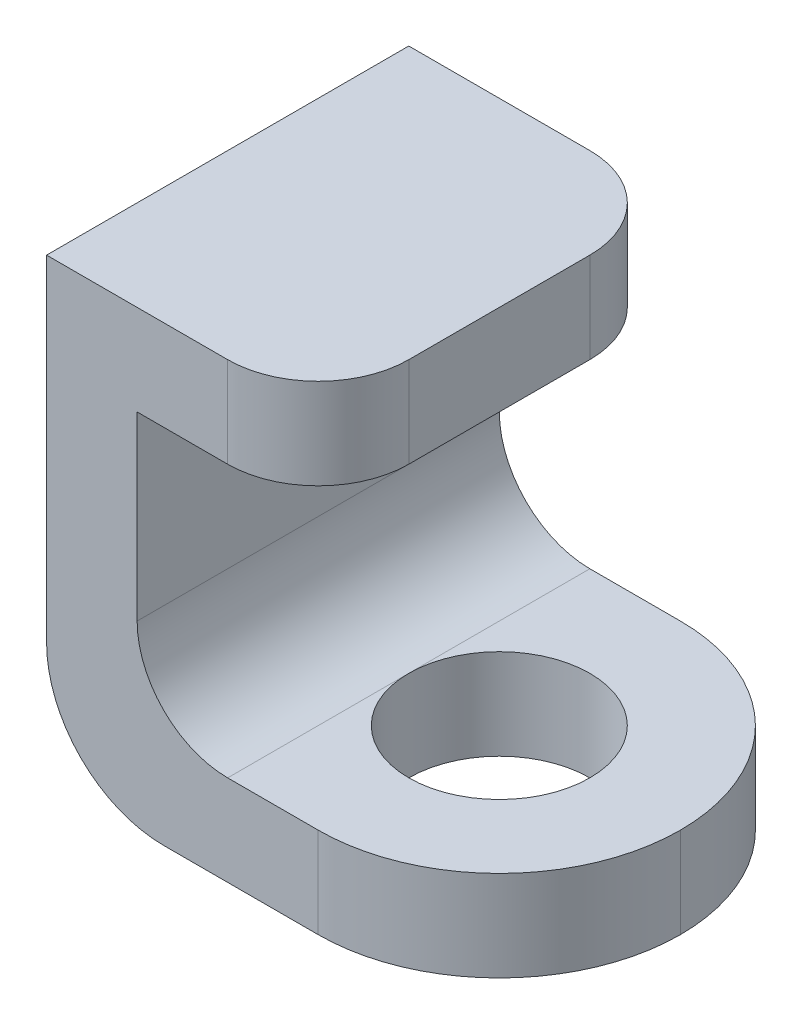
ISO-10303-21;
HEADER;
FILE_DESCRIPTION(('STEP AP214'),'2;1');
FILE_NAME('part.step','',(''),(''),'','','');
FILE_SCHEMA(('AUTOMOTIVE_DESIGN { 1 0 10303 214 1 1 1 1 }'));
ENDSEC;
DATA;
#1=APPLICATION_CONTEXT('core data for automotive mechanical design processes');
#2=APPLICATION_PROTOCOL_DEFINITION('international standard','automotive_design',2000,#1);
#3=PRODUCT_CONTEXT('',#1,'mechanical');
#4=PRODUCT('Part','Part','',(#3));
#5=PRODUCT_RELATED_PRODUCT_CATEGORY('part','',(#4));
#6=PRODUCT_DEFINITION_FORMATION('','',#4);
#7=PRODUCT_DEFINITION_CONTEXT('part definition',#1,'design');
#8=PRODUCT_DEFINITION('design','',#6,#7);
#9=PRODUCT_DEFINITION_SHAPE('','',#8);
#10=(LENGTH_UNIT() NAMED_UNIT(*) SI_UNIT(.MILLI.,.METRE.));
#11=(NAMED_UNIT(*) PLANE_ANGLE_UNIT() SI_UNIT($,.RADIAN.));
#12=(NAMED_UNIT(*) SI_UNIT($,.STERADIAN.) SOLID_ANGLE_UNIT());
#13=UNCERTAINTY_MEASURE_WITH_UNIT(LENGTH_MEASURE(1.E-05),#10,'distance_accuracy_value','');
#14=(GEOMETRIC_REPRESENTATION_CONTEXT(3) GLOBAL_UNCERTAINTY_ASSIGNED_CONTEXT((#13)) GLOBAL_UNIT_ASSIGNED_CONTEXT((#10,
#11,#12)) REPRESENTATION_CONTEXT('',''));
#15=CARTESIAN_POINT('',(0.,0.,0.));
#16=DIRECTION('',(0.,0.,1.));
#17=DIRECTION('',(1.,0.,0.));
#18=AXIS2_PLACEMENT_3D('',#15,#16,#17);
#19=CARTESIAN_POINT('',(-25.,50.,-20.));
#20=DIRECTION('',(0.,0.,1.));
#21=DIRECTION('',(1.,0.,0.));
#22=AXIS2_PLACEMENT_3D('',#19,#20,#21);
#23=PLANE('',#22);
#24=DIRECTION('',(1.,0.,0.));
#25=VECTOR('',#24,1.);
#26=CARTESIAN_POINT('',(0.,10.,-20.));
#27=LINE('',#26,#25);
#28=CARTESIAN_POINT('',(-5.,10.,-20.));
#29=VERTEX_POINT('',#28);
#30=CARTESIAN_POINT('',(5.,10.,-20.));
#31=VERTEX_POINT('',#30);
#32=EDGE_CURVE('E221',#29,#31,#27,.T.);
#33=ORIENTED_EDGE('',*,*,#32,.T.);
#34=DIRECTION('',(0.,-1.,0.));
#35=VECTOR('',#34,1.);
#36=CARTESIAN_POINT('',(5.,50.,-20.));
#37=LINE('',#36,#35);
#38=CARTESIAN_POINT('',(5.,0.,-20.));
#39=VERTEX_POINT('',#38);
#40=EDGE_CURVE('E210',#31,#39,#37,.T.);
#41=ORIENTED_EDGE('',*,*,#40,.T.);
#42=DIRECTION('',(-1.,0.,0.));
#43=VECTOR('',#42,1.);
#44=CARTESIAN_POINT('',(-25.,0.,-20.));
#45=LINE('',#44,#43);
#46=CARTESIAN_POINT('',(-12.0710678118655,0.,-20.));
#47=VERTEX_POINT('',#46);
#48=EDGE_CURVE('E182',#39,#47,#45,.T.);
#49=ORIENTED_EDGE('',*,*,#48,.T.);
#50=CARTESIAN_POINT('',(-12.0710678118655,12.9289321881345,-20.));
#51=DIRECTION('',(0.,0.,1.));
#52=DIRECTION('',(1.,0.,0.));
#53=AXIS2_PLACEMENT_3D('',#50,#51,#52);
#54=CIRCLE('',#53,12.9289321881345);
#55=CARTESIAN_POINT('',(-25.,12.9289321881345,-20.));
#56=VERTEX_POINT('',#55);
#57=EDGE_CURVE('E163',#47,#56,#54,.F.);
#58=ORIENTED_EDGE('',*,*,#57,.T.);
#59=DIRECTION('',(0.,-1.,0.));
#60=VECTOR('',#59,1.);
#61=CARTESIAN_POINT('',(-25.,50.,-20.));
#62=LINE('',#61,#60);
#63=CARTESIAN_POINT('',(-25.,50.,-20.));
#64=VERTEX_POINT('',#63);
#65=EDGE_CURVE('E178',#64,#56,#62,.T.);
#66=ORIENTED_EDGE('',*,*,#65,.F.);
#67=DIRECTION('',(-1.,0.,0.));
#68=VECTOR('',#67,1.);
#69=CARTESIAN_POINT('',(-25.,50.,-20.));
#70=LINE('',#69,#68);
#71=CARTESIAN_POINT('',(-5.,50.,-20.));
#72=VERTEX_POINT('',#71);
#73=EDGE_CURVE('E269',#72,#64,#70,.T.);
#74=ORIENTED_EDGE('',*,*,#73,.F.);
#75=DIRECTION('',(0.,-1.,0.));
#76=VECTOR('',#75,1.);
#77=CARTESIAN_POINT('',(-5.,50.,-20.));
#78=LINE('',#77,#76);
#79=CARTESIAN_POINT('',(-5.,40.,-20.));
#80=VERTEX_POINT('',#79);
#81=EDGE_CURVE('E186',#72,#80,#78,.T.);
#82=ORIENTED_EDGE('',*,*,#81,.T.);
#83=DIRECTION('',(-1.,0.,0.));
#84=VECTOR('',#83,1.);
#85=CARTESIAN_POINT('',(0.,40.,-20.));
#86=LINE('',#85,#84);
#87=CARTESIAN_POINT('',(-15.,40.,-20.));
#88=VERTEX_POINT('',#87);
#89=EDGE_CURVE('E229',#80,#88,#86,.T.);
#90=ORIENTED_EDGE('',*,*,#89,.T.);
#91=DIRECTION('',(0.,-1.,0.));
#92=VECTOR('',#91,1.);
#93=CARTESIAN_POINT('',(-15.,0.,-20.));
#94=LINE('',#93,#92);
#95=CARTESIAN_POINT('',(-15.,20.,-20.));
#96=VERTEX_POINT('',#95);
#97=EDGE_CURVE('E251',#88,#96,#94,.T.);
#98=ORIENTED_EDGE('',*,*,#97,.T.);
#99=CARTESIAN_POINT('',(-5.,20.,-20.));
#100=DIRECTION('',(0.,0.,1.));
#101=DIRECTION('',(1.,0.,0.));
#102=AXIS2_PLACEMENT_3D('',#99,#100,#101);
#103=CIRCLE('',#102,10.);
#104=EDGE_CURVE('E228',#96,#29,#103,.T.);
#105=ORIENTED_EDGE('',*,*,#104,.T.);
#106=EDGE_LOOP('',(#33,#41,#49,#58,#66,#74,#82,#90,#98,#105));
#107=FACE_BOUND('',#106,.T.);
#108=ADVANCED_FACE('F62',(#107),#23,.F.);
#109=CARTESIAN_POINT('',(-25.,50.,20.));
#110=DIRECTION('',(1.,0.,0.));
#111=DIRECTION('',(0.,0.,-1.));
#112=AXIS2_PLACEMENT_3D('',#109,#110,#111);
#113=PLANE('',#112);
#114=DIRECTION('',(0.,0.,1.));
#115=VECTOR('',#114,1.);
#116=CARTESIAN_POINT('',(-25.,12.9289321881345,-20.));
#117=LINE('',#116,#115);
#118=CARTESIAN_POINT('',(-25.,12.9289321881345,20.));
#119=VERTEX_POINT('',#118);
#120=EDGE_CURVE('E160',#56,#119,#117,.T.);
#121=ORIENTED_EDGE('',*,*,#120,.T.);
#122=DIRECTION('',(0.,-1.,0.));
#123=VECTOR('',#122,1.);
#124=CARTESIAN_POINT('',(-25.,50.,20.));
#125=LINE('',#124,#123);
#126=CARTESIAN_POINT('',(-25.,50.,20.));
#127=VERTEX_POINT('',#126);
#128=EDGE_CURVE('E187',#127,#119,#125,.T.);
#129=ORIENTED_EDGE('',*,*,#128,.F.);
#130=DIRECTION('',(0.,0.,1.));
#131=VECTOR('',#130,1.);
#132=CARTESIAN_POINT('',(-25.,50.,20.));
#133=LINE('',#132,#131);
#134=EDGE_CURVE('E185',#64,#127,#133,.T.);
#135=ORIENTED_EDGE('',*,*,#134,.F.);
#136=ORIENTED_EDGE('',*,*,#65,.T.);
#137=EDGE_LOOP('',(#121,#129,#135,#136));
#138=FACE_BOUND('',#137,.T.);
#139=ADVANCED_FACE('F184',(#138),#113,.F.);
#140=CARTESIAN_POINT('',(-25.,50.,20.));
#141=DIRECTION('',(0.,0.,-1.));
#142=DIRECTION('',(-1.,0.,0.));
#143=AXIS2_PLACEMENT_3D('',#140,#141,#142);
#144=PLANE('',#143);
#145=DIRECTION('',(1.,0.,0.));
#146=VECTOR('',#145,1.);
#147=CARTESIAN_POINT('',(-25.,0.,20.));
#148=LINE('',#147,#146);
#149=CARTESIAN_POINT('',(-12.0710678118655,0.,20.));
#150=VERTEX_POINT('',#149);
#151=CARTESIAN_POINT('',(5.,0.,20.));
#152=VERTEX_POINT('',#151);
#153=EDGE_CURVE('E244',#150,#152,#148,.T.);
#154=ORIENTED_EDGE('',*,*,#153,.T.);
#155=DIRECTION('',(0.,-1.,0.));
#156=VECTOR('',#155,1.);
#157=CARTESIAN_POINT('',(5.,50.,20.));
#158=LINE('',#157,#156);
#159=CARTESIAN_POINT('',(5.,10.,20.));
#160=VERTEX_POINT('',#159);
#161=EDGE_CURVE('E12',#152,#160,#158,.F.);
#162=ORIENTED_EDGE('',*,*,#161,.T.);
#163=DIRECTION('',(1.,0.,0.));
#164=VECTOR('',#163,1.);
#165=CARTESIAN_POINT('',(0.,10.,20.));
#166=LINE('',#165,#164);
#167=CARTESIAN_POINT('',(-5.,10.,20.));
#168=VERTEX_POINT('',#167);
#169=EDGE_CURVE('E243',#168,#160,#166,.T.);
#170=ORIENTED_EDGE('',*,*,#169,.F.);
#171=CARTESIAN_POINT('',(-5.,20.,20.));
#172=DIRECTION('',(0.,0.,1.));
#173=DIRECTION('',(1.,0.,0.));
#174=AXIS2_PLACEMENT_3D('',#171,#172,#173);
#175=CIRCLE('',#174,10.);
#176=CARTESIAN_POINT('',(-15.,20.,20.));
#177=VERTEX_POINT('',#176);
#178=EDGE_CURVE('E249',#177,#168,#175,.T.);
#179=ORIENTED_EDGE('',*,*,#178,.F.);
#180=DIRECTION('',(0.,-1.,0.));
#181=VECTOR('',#180,1.);
#182=CARTESIAN_POINT('',(-15.,0.,20.));
#183=LINE('',#182,#181);
#184=CARTESIAN_POINT('',(-15.,40.,20.));
#185=VERTEX_POINT('',#184);
#186=EDGE_CURVE('E171',#185,#177,#183,.T.);
#187=ORIENTED_EDGE('',*,*,#186,.F.);
#188=DIRECTION('',(-1.,0.,0.));
#189=VECTOR('',#188,1.);
#190=CARTESIAN_POINT('',(0.,40.,20.));
#191=LINE('',#190,#189);
#192=CARTESIAN_POINT('',(-5.,40.,20.));
#193=VERTEX_POINT('',#192);
#194=EDGE_CURVE('E248',#193,#185,#191,.T.);
#195=ORIENTED_EDGE('',*,*,#194,.F.);
#196=DIRECTION('',(0.,-1.,0.));
#197=VECTOR('',#196,1.);
#198=CARTESIAN_POINT('',(-5.,50.,20.));
#199=LINE('',#198,#197);
#200=CARTESIAN_POINT('',(-5.,50.,20.));
#201=VERTEX_POINT('',#200);
#202=EDGE_CURVE('E208',#193,#201,#199,.F.);
#203=ORIENTED_EDGE('',*,*,#202,.T.);
#204=DIRECTION('',(1.,0.,0.));
#205=VECTOR('',#204,1.);
#206=CARTESIAN_POINT('',(-25.,50.,20.));
#207=LINE('',#206,#205);
#208=EDGE_CURVE('E192',#127,#201,#207,.T.);
#209=ORIENTED_EDGE('',*,*,#208,.F.);
#210=ORIENTED_EDGE('',*,*,#128,.T.);
#211=CARTESIAN_POINT('',(-12.0710678118655,12.9289321881345,20.));
#212=DIRECTION('',(0.,0.,1.));
#213=DIRECTION('',(1.,0.,0.));
#214=AXIS2_PLACEMENT_3D('',#211,#212,#213);
#215=CIRCLE('',#214,12.9289321881345);
#216=EDGE_CURVE('E166',#150,#119,#215,.F.);
#217=ORIENTED_EDGE('',*,*,#216,.F.);
#218=EDGE_LOOP('',(#154,#162,#170,#179,#187,#195,#203,#209,#210,#217));
#219=FACE_BOUND('',#218,.T.);
#220=ADVANCED_FACE('F241',(#219),#144,.F.);
#221=CARTESIAN_POINT('',(0.,0.,0.));
#222=DIRECTION('',(0.,-1.,0.));
#223=DIRECTION('',(0.,0.,-1.));
#224=AXIS2_PLACEMENT_3D('',#221,#222,#223);
#225=PLANE('',#224);
#226=CARTESIAN_POINT('',(5.,0.,0.));
#227=DIRECTION('',(0.,-1.,0.));
#228=DIRECTION('',(0.,0.,-1.));
#229=AXIS2_PLACEMENT_3D('',#226,#227,#228);
#230=CIRCLE('',#229,10.);
#231=CARTESIAN_POINT('',(5.,0.,-10.));
#232=VERTEX_POINT('',#231);
#233=EDGE_CURVE('E307',#232,#232,#230,.T.);
#234=ORIENTED_EDGE('',*,*,#233,.F.);
#235=EDGE_LOOP('',(#234));
#236=FACE_BOUND('',#235,.T.);
#237=ORIENTED_EDGE('',*,*,#48,.F.);
#238=CARTESIAN_POINT('',(5.,0.,0.));
#239=DIRECTION('',(0.,-1.,0.));
#240=DIRECTION('',(0.,0.,-1.));
#241=AXIS2_PLACEMENT_3D('',#238,#239,#240);
#242=CIRCLE('',#241,20.);
#243=CARTESIAN_POINT('',(25.,0.,0.));
#244=VERTEX_POINT('',#243);
#245=EDGE_CURVE('E214',#39,#244,#242,.T.);
#246=ORIENTED_EDGE('',*,*,#245,.T.);
#247=CARTESIAN_POINT('',(5.,0.,0.));
#248=DIRECTION('',(0.,-1.,0.));
#249=DIRECTION('',(0.,0.,-1.));
#250=AXIS2_PLACEMENT_3D('',#247,#248,#249);
#251=CIRCLE('',#250,20.);
#252=EDGE_CURVE('E212',#244,#152,#251,.T.);
#253=ORIENTED_EDGE('',*,*,#252,.T.);
#254=ORIENTED_EDGE('',*,*,#153,.F.);
#255=DIRECTION('',(0.,0.,1.));
#256=VECTOR('',#255,1.);
#257=CARTESIAN_POINT('',(-12.0710678118655,0.,-20.));
#258=LINE('',#257,#256);
#259=EDGE_CURVE('E172',#47,#150,#258,.T.);
#260=ORIENTED_EDGE('',*,*,#259,.F.);
#261=EDGE_LOOP('',(#237,#246,#253,#254,#260));
#262=FACE_BOUND('',#261,.T.);
#263=ADVANCED_FACE('F234',(#236,#262),#225,.T.);
#264=CARTESIAN_POINT('',(0.,50.,0.));
#265=DIRECTION('',(0.,-1.,0.));
#266=DIRECTION('',(0.,0.,-1.));
#267=AXIS2_PLACEMENT_3D('',#264,#265,#266);
#268=PLANE('',#267);
#269=DIRECTION('',(0.,0.,1.));
#270=VECTOR('',#269,1.);
#271=CARTESIAN_POINT('',(5.,50.,-20.));
#272=LINE('',#271,#270);
#273=CARTESIAN_POINT('',(5.,50.,-10.));
#274=VERTEX_POINT('',#273);
#275=CARTESIAN_POINT('',(5.,50.,9.99999999999999));
#276=VERTEX_POINT('',#275);
#277=EDGE_CURVE('E262',#274,#276,#272,.T.);
#278=ORIENTED_EDGE('',*,*,#277,.F.);
#279=CARTESIAN_POINT('',(-5.,50.,-10.));
#280=DIRECTION('',(0.,-1.,0.));
#281=DIRECTION('',(0.,0.,-1.));
#282=AXIS2_PLACEMENT_3D('',#279,#280,#281);
#283=CIRCLE('',#282,10.);
#284=EDGE_CURVE('E206',#274,#72,#283,.F.);
#285=ORIENTED_EDGE('',*,*,#284,.T.);
#286=ORIENTED_EDGE('',*,*,#73,.T.);
#287=ORIENTED_EDGE('',*,*,#134,.T.);
#288=ORIENTED_EDGE('',*,*,#208,.T.);
#289=CARTESIAN_POINT('',(-5.,50.,9.99999999999999));
#290=DIRECTION('',(0.,-1.,0.));
#291=DIRECTION('',(0.,0.,-1.));
#292=AXIS2_PLACEMENT_3D('',#289,#290,#291);
#293=CIRCLE('',#292,10.);
#294=EDGE_CURVE('E204',#201,#276,#293,.F.);
#295=ORIENTED_EDGE('',*,*,#294,.T.);
#296=EDGE_LOOP('',(#278,#285,#286,#287,#288,#295));
#297=FACE_BOUND('',#296,.T.);
#298=ADVANCED_FACE('F278',(#297),#268,.F.);
#299=CARTESIAN_POINT('',(-15.,0.,-20.));
#300=DIRECTION('',(-1.,0.,0.));
#301=DIRECTION('',(0.,-1.,0.));
#302=AXIS2_PLACEMENT_3D('',#299,#300,#301);
#303=PLANE('',#302);
#304=ORIENTED_EDGE('',*,*,#186,.T.);
#305=DIRECTION('',(0.,0.,1.));
#306=VECTOR('',#305,1.);
#307=CARTESIAN_POINT('',(-15.,20.,-20.));
#308=LINE('',#307,#306);
#309=EDGE_CURVE('E267',#96,#177,#308,.T.);
#310=ORIENTED_EDGE('',*,*,#309,.F.);
#311=ORIENTED_EDGE('',*,*,#97,.F.);
#312=DIRECTION('',(0.,0.,1.));
#313=VECTOR('',#312,1.);
#314=CARTESIAN_POINT('',(-15.,40.,-20.));
#315=LINE('',#314,#313);
#316=EDGE_CURVE('E256',#88,#185,#315,.T.);
#317=ORIENTED_EDGE('',*,*,#316,.T.);
#318=EDGE_LOOP('',(#304,#310,#311,#317));
#319=FACE_BOUND('',#318,.T.);
#320=ADVANCED_FACE('F301',(#319),#303,.F.);
#321=CARTESIAN_POINT('',(0.,40.,-20.));
#322=DIRECTION('',(0.,1.,0.));
#323=DIRECTION('',(0.,0.,1.));
#324=AXIS2_PLACEMENT_3D('',#321,#322,#323);
#325=PLANE('',#324);
#326=ORIENTED_EDGE('',*,*,#89,.F.);
#327=CARTESIAN_POINT('',(-5.,40.,-10.));
#328=DIRECTION('',(0.,1.,0.));
#329=DIRECTION('',(0.,0.,1.));
#330=AXIS2_PLACEMENT_3D('',#327,#328,#329);
#331=CIRCLE('',#330,10.);
#332=CARTESIAN_POINT('',(5.,40.,-10.));
#333=VERTEX_POINT('',#332);
#334=EDGE_CURVE('E197',#80,#333,#331,.F.);
#335=ORIENTED_EDGE('',*,*,#334,.T.);
#336=DIRECTION('',(0.,0.,1.));
#337=VECTOR('',#336,1.);
#338=CARTESIAN_POINT('',(5.,40.,-20.));
#339=LINE('',#338,#337);
#340=CARTESIAN_POINT('',(5.,40.,9.99999999999999));
#341=VERTEX_POINT('',#340);
#342=EDGE_CURVE('E259',#333,#341,#339,.T.);
#343=ORIENTED_EDGE('',*,*,#342,.T.);
#344=CARTESIAN_POINT('',(-5.,40.,9.99999999999999));
#345=DIRECTION('',(0.,1.,0.));
#346=DIRECTION('',(0.,0.,1.));
#347=AXIS2_PLACEMENT_3D('',#344,#345,#346);
#348=CIRCLE('',#347,10.);
#349=EDGE_CURVE('E190',#341,#193,#348,.F.);
#350=ORIENTED_EDGE('',*,*,#349,.T.);
#351=ORIENTED_EDGE('',*,*,#194,.T.);
#352=ORIENTED_EDGE('',*,*,#316,.F.);
#353=EDGE_LOOP('',(#326,#335,#343,#350,#351,#352));
#354=FACE_BOUND('',#353,.T.);
#355=ADVANCED_FACE('F289',(#354),#325,.F.);
#356=CARTESIAN_POINT('',(5.,0.,-20.));
#357=DIRECTION('',(-1.,0.,0.));
#358=DIRECTION('',(0.,0.,1.));
#359=AXIS2_PLACEMENT_3D('',#356,#357,#358);
#360=PLANE('',#359);
#361=ORIENTED_EDGE('',*,*,#342,.F.);
#362=DIRECTION('',(0.,-1.,0.));
#363=VECTOR('',#362,1.);
#364=CARTESIAN_POINT('',(5.,0.,-10.));
#365=LINE('',#364,#363);
#366=EDGE_CURVE('E202',#333,#274,#365,.F.);
#367=ORIENTED_EDGE('',*,*,#366,.T.);
#368=ORIENTED_EDGE('',*,*,#277,.T.);
#369=DIRECTION('',(0.,-1.,0.));
#370=VECTOR('',#369,1.);
#371=CARTESIAN_POINT('',(5.,0.,9.99999999999999));
#372=LINE('',#371,#370);
#373=EDGE_CURVE('E199',#276,#341,#372,.T.);
#374=ORIENTED_EDGE('',*,*,#373,.T.);
#375=EDGE_LOOP('',(#361,#367,#368,#374));
#376=FACE_BOUND('',#375,.T.);
#377=ADVANCED_FACE('F285',(#376),#360,.F.);
#378=CARTESIAN_POINT('',(0.,10.,-20.));
#379=DIRECTION('',(0.,-1.,0.));
#380=DIRECTION('',(1.,0.,0.));
#381=AXIS2_PLACEMENT_3D('',#378,#379,#380);
#382=PLANE('',#381);
#383=DIRECTION('',(0.,0.,1.));
#384=VECTOR('',#383,1.);
#385=CARTESIAN_POINT('',(-5.,10.,-20.));
#386=LINE('',#385,#384);
#387=CARTESIAN_POINT('',(-5.,10.,0.));
#388=VERTEX_POINT('',#387);
#389=EDGE_CURVE('E265',#29,#388,#386,.T.);
#390=ORIENTED_EDGE('',*,*,#389,.T.);
#391=CARTESIAN_POINT('',(5.,10.,0.));
#392=DIRECTION('',(0.,1.,0.));
#393=DIRECTION('',(-1.,0.,0.));
#394=AXIS2_PLACEMENT_3D('',#391,#392,#393);
#395=CIRCLE('',#394,10.);
#396=EDGE_CURVE('E76',#388,#388,#395,.T.);
#397=ORIENTED_EDGE('',*,*,#396,.F.);
#398=EDGE_CURVE('E246',#388,#168,#386,.T.);
#399=ORIENTED_EDGE('',*,*,#398,.T.);
#400=ORIENTED_EDGE('',*,*,#169,.T.);
#401=CARTESIAN_POINT('',(5.,9.99999999999999,0.));
#402=DIRECTION('',(0.,-1.,0.));
#403=DIRECTION('',(1.,0.,0.));
#404=AXIS2_PLACEMENT_3D('',#401,#402,#403);
#405=CIRCLE('',#404,20.);
#406=CARTESIAN_POINT('',(25.,9.99999999999999,0.));
#407=VERTEX_POINT('',#406);
#408=EDGE_CURVE('E83',#160,#407,#405,.F.);
#409=ORIENTED_EDGE('',*,*,#408,.T.);
#410=CARTESIAN_POINT('',(5.,9.99999999999999,0.));
#411=DIRECTION('',(0.,-1.,0.));
#412=DIRECTION('',(1.,0.,0.));
#413=AXIS2_PLACEMENT_3D('',#410,#411,#412);
#414=CIRCLE('',#413,20.);
#415=EDGE_CURVE('E71',#407,#31,#414,.F.);
#416=ORIENTED_EDGE('',*,*,#415,.T.);
#417=ORIENTED_EDGE('',*,*,#32,.F.);
#418=EDGE_LOOP('',(#390,#397,#399,#400,#409,#416,#417));
#419=FACE_BOUND('',#418,.T.);
#420=ADVANCED_FACE('F220',(#419),#382,.F.);
#421=CARTESIAN_POINT('',(-5.,20.,-20.));
#422=DIRECTION('',(0.,0.,1.));
#423=DIRECTION('',(1.,0.,0.));
#424=AXIS2_PLACEMENT_3D('',#421,#422,#423);
#425=CYLINDRICAL_SURFACE('',#424,10.);
#426=ORIENTED_EDGE('',*,*,#178,.T.);
#427=ORIENTED_EDGE('',*,*,#398,.F.);
#428=ORIENTED_EDGE('',*,*,#389,.F.);
#429=ORIENTED_EDGE('',*,*,#104,.F.);
#430=ORIENTED_EDGE('',*,*,#309,.T.);
#431=EDGE_LOOP('',(#426,#427,#428,#429,#430));
#432=FACE_BOUND('',#431,.T.);
#433=ADVANCED_FACE('F306',(#432),#425,.F.);
#434=CARTESIAN_POINT('',(-12.0710678118655,12.9289321881345,-20.));
#435=DIRECTION('',(0.,0.,1.));
#436=DIRECTION('',(1.,0.,0.));
#437=AXIS2_PLACEMENT_3D('',#434,#435,#436);
#438=CYLINDRICAL_SURFACE('',#437,12.9289321881345);
#439=ORIENTED_EDGE('',*,*,#216,.T.);
#440=ORIENTED_EDGE('',*,*,#120,.F.);
#441=ORIENTED_EDGE('',*,*,#57,.F.);
#442=ORIENTED_EDGE('',*,*,#259,.T.);
#443=EDGE_LOOP('',(#439,#440,#441,#442));
#444=FACE_BOUND('',#443,.T.);
#445=ADVANCED_FACE('F162',(#444),#438,.T.);
#446=CARTESIAN_POINT('',(-5.,50.,-10.));
#447=DIRECTION('',(0.,-1.,0.));
#448=DIRECTION('',(0.,0.,-1.));
#449=AXIS2_PLACEMENT_3D('',#446,#447,#448);
#450=CYLINDRICAL_SURFACE('',#449,10.);
#451=ORIENTED_EDGE('',*,*,#284,.F.);
#452=ORIENTED_EDGE('',*,*,#366,.F.);
#453=ORIENTED_EDGE('',*,*,#334,.F.);
#454=ORIENTED_EDGE('',*,*,#81,.F.);
#455=EDGE_LOOP('',(#451,#452,#453,#454));
#456=FACE_BOUND('',#455,.T.);
#457=ADVANCED_FACE('F295',(#456),#450,.T.);
#458=CARTESIAN_POINT('',(-5.,0.,9.99999999999999));
#459=DIRECTION('',(0.,-1.,0.));
#460=DIRECTION('',(0.,0.,-1.));
#461=AXIS2_PLACEMENT_3D('',#458,#459,#460);
#462=CYLINDRICAL_SURFACE('',#461,10.);
#463=ORIENTED_EDGE('',*,*,#294,.F.);
#464=ORIENTED_EDGE('',*,*,#202,.F.);
#465=ORIENTED_EDGE('',*,*,#349,.F.);
#466=ORIENTED_EDGE('',*,*,#373,.F.);
#467=EDGE_LOOP('',(#463,#464,#465,#466));
#468=FACE_BOUND('',#467,.T.);
#469=ADVANCED_FACE('F282',(#468),#462,.T.);
#470=CARTESIAN_POINT('',(5.,50.,0.));
#471=DIRECTION('',(0.,-1.,0.));
#472=DIRECTION('',(0.,0.,-1.));
#473=AXIS2_PLACEMENT_3D('',#470,#471,#472);
#474=CYLINDRICAL_SURFACE('',#473,20.);
#475=DIRECTION('',(0.,-1.,0.));
#476=VECTOR('',#475,1.);
#477=CARTESIAN_POINT('',(25.,50.,0.));
#478=LINE('',#477,#476);
#479=EDGE_CURVE('E66',#407,#244,#478,.T.);
#480=ORIENTED_EDGE('',*,*,#479,.F.);
#481=ORIENTED_EDGE('',*,*,#408,.F.);
#482=ORIENTED_EDGE('',*,*,#161,.F.);
#483=ORIENTED_EDGE('',*,*,#252,.F.);
#484=EDGE_LOOP('',(#480,#481,#482,#483));
#485=FACE_BOUND('',#484,.T.);
#486=ADVANCED_FACE('F64',(#485),#474,.T.);
#487=CARTESIAN_POINT('',(5.,50.,0.));
#488=DIRECTION('',(0.,-1.,0.));
#489=DIRECTION('',(0.,0.,-1.));
#490=AXIS2_PLACEMENT_3D('',#487,#488,#489);
#491=CYLINDRICAL_SURFACE('',#490,20.);
#492=ORIENTED_EDGE('',*,*,#415,.F.);
#493=ORIENTED_EDGE('',*,*,#479,.T.);
#494=ORIENTED_EDGE('',*,*,#245,.F.);
#495=ORIENTED_EDGE('',*,*,#40,.F.);
#496=EDGE_LOOP('',(#492,#493,#494,#495));
#497=FACE_BOUND('',#496,.T.);
#498=ADVANCED_FACE('F231',(#497),#491,.T.);
#499=CARTESIAN_POINT('',(5.,-40.,0.));
#500=DIRECTION('',(0.,1.,0.));
#501=DIRECTION('',(-1.,0.,0.));
#502=AXIS2_PLACEMENT_3D('',#499,#500,#501);
#503=CYLINDRICAL_SURFACE('',#502,10.);
#504=ORIENTED_EDGE('',*,*,#233,.T.);
#505=EDGE_LOOP('',(#504));
#506=FACE_BOUND('',#505,.T.);
#507=ORIENTED_EDGE('',*,*,#396,.T.);
#508=EDGE_LOOP('',(#507));
#509=FACE_BOUND('',#508,.T.);
#510=ADVANCED_FACE('F314',(#506,#509),#503,.F.);
#511=CLOSED_SHELL('',(#108,#139,#220,#263,#298,#320,#355,#377,#420,#433,#445,#457,#469,#486,
#498,#510));
#512=MANIFOLD_SOLID_BREP('B2',#511);
#513=ADVANCED_BREP_SHAPE_REPRESENTATION('',(#18,#512),#14);
#514=SHAPE_DEFINITION_REPRESENTATION(#9,#513);
ENDSEC;
END-ISO-10303-21;
